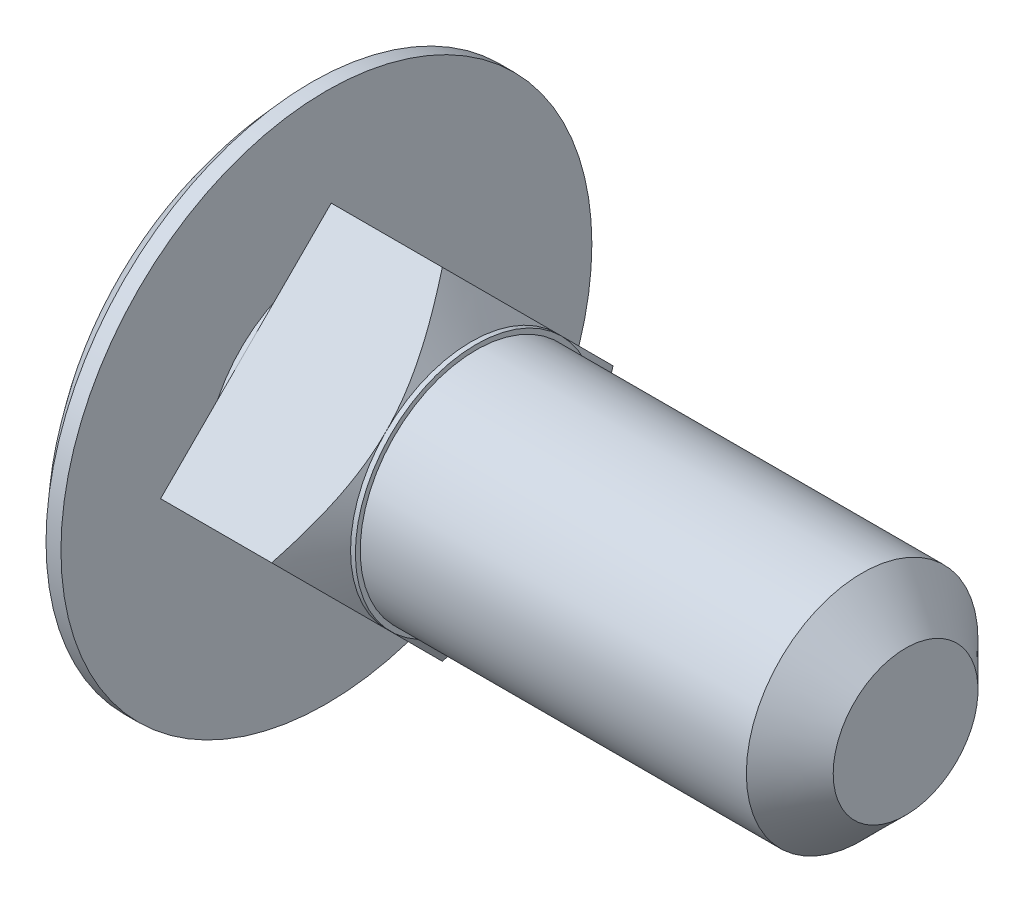
ISO-10303-21;
HEADER;
FILE_DESCRIPTION(('STEP AP214'),'2;1');
FILE_NAME('part.step','',(''),(''),'','','');
FILE_SCHEMA(('AUTOMOTIVE_DESIGN { 1 0 10303 214 1 1 1 1 }'));
ENDSEC;
DATA;
#1=APPLICATION_CONTEXT('core data for automotive mechanical design processes');
#2=APPLICATION_PROTOCOL_DEFINITION('international standard','automotive_design',2000,#1);
#3=PRODUCT_CONTEXT('',#1,'mechanical');
#4=PRODUCT('Part','Part','',(#3));
#5=PRODUCT_RELATED_PRODUCT_CATEGORY('part','',(#4));
#6=PRODUCT_DEFINITION_FORMATION('','',#4);
#7=PRODUCT_DEFINITION_CONTEXT('part definition',#1,'design');
#8=PRODUCT_DEFINITION('design','',#6,#7);
#9=PRODUCT_DEFINITION_SHAPE('','',#8);
#10=(LENGTH_UNIT() NAMED_UNIT(*) SI_UNIT(.MILLI.,.METRE.));
#11=(NAMED_UNIT(*) PLANE_ANGLE_UNIT() SI_UNIT($,.RADIAN.));
#12=(NAMED_UNIT(*) SI_UNIT($,.STERADIAN.) SOLID_ANGLE_UNIT());
#13=UNCERTAINTY_MEASURE_WITH_UNIT(LENGTH_MEASURE(1.E-05),#10,'distance_accuracy_value','');
#14=(GEOMETRIC_REPRESENTATION_CONTEXT(3) GLOBAL_UNCERTAINTY_ASSIGNED_CONTEXT((#13)) GLOBAL_UNIT_ASSIGNED_CONTEXT((#10,
#11,#12)) REPRESENTATION_CONTEXT('',''));
#15=CARTESIAN_POINT('',(0.,0.,0.));
#16=DIRECTION('',(0.,0.,1.));
#17=DIRECTION('',(1.,0.,0.));
#18=AXIS2_PLACEMENT_3D('',#15,#16,#17);
#19=CARTESIAN_POINT('',(-123.766149148481,0.,0.));
#20=DIRECTION('',(-1.,0.,0.));
#21=DIRECTION('',(0.,0.,1.));
#22=AXIS2_PLACEMENT_3D('',#19,#20,#21);
#23=CYLINDRICAL_SURFACE('',#22,2.49999999999999);
#24=CARTESIAN_POINT('',(3.,0.,0.));
#25=DIRECTION('',(-1.,0.,0.));
#26=DIRECTION('',(0.,0.,1.));
#27=AXIS2_PLACEMENT_3D('',#24,#25,#26);
#28=CIRCLE('',#27,2.49999999999999);
#29=CARTESIAN_POINT('',(3.,1.76776695296636,1.76776695296636));
#30=VERTEX_POINT('',#29);
#31=CARTESIAN_POINT('',(3.,1.76776695296636,-1.76776695296636));
#32=VERTEX_POINT('',#31);
#33=EDGE_CURVE('E116',#30,#32,#28,.T.);
#34=ORIENTED_EDGE('',*,*,#33,.F.);
#35=CARTESIAN_POINT('',(3.,0.,0.));
#36=DIRECTION('',(-1.,0.,0.));
#37=DIRECTION('',(0.,0.,1.));
#38=AXIS2_PLACEMENT_3D('',#35,#36,#37);
#39=CIRCLE('',#38,2.49999999999999);
#40=CARTESIAN_POINT('',(3.,-1.76776695296636,1.76776695296636));
#41=VERTEX_POINT('',#40);
#42=EDGE_CURVE('E130',#41,#30,#39,.T.);
#43=ORIENTED_EDGE('',*,*,#42,.F.);
#44=CARTESIAN_POINT('',(3.,-1.76776695296636,-1.76776695296636));
#45=VERTEX_POINT('',#44);
#46=EDGE_CURVE('E63',#45,#41,#39,.T.);
#47=ORIENTED_EDGE('',*,*,#46,.F.);
#48=EDGE_CURVE('E70',#32,#45,#39,.T.);
#49=ORIENTED_EDGE('',*,*,#48,.F.);
#50=EDGE_LOOP('',(#34,#43,#47,#49));
#51=FACE_BOUND('',#50,.T.);
#52=CARTESIAN_POINT('',(3.1,0.,0.));
#53=DIRECTION('',(1.,0.,0.));
#54=DIRECTION('',(0.,0.,-1.));
#55=AXIS2_PLACEMENT_3D('',#52,#53,#54);
#56=CIRCLE('',#55,2.49999999999999);
#57=CARTESIAN_POINT('',(3.1,0.,-2.49999999999999));
#58=VERTEX_POINT('',#57);
#59=EDGE_CURVE('E259',#58,#58,#56,.T.);
#60=ORIENTED_EDGE('',*,*,#59,.F.);
#61=EDGE_LOOP('',(#60));
#62=FACE_BOUND('',#61,.T.);
#63=ADVANCED_FACE('F45',(#51,#62),#23,.T.);
#64=CARTESIAN_POINT('',(16.,0.,-3.53553390593273));
#65=DIRECTION('',(0.,0.707106781186548,0.707106781186547));
#66=DIRECTION('',(0.,-0.707106781186547,0.707106781186548));
#67=AXIS2_PLACEMENT_3D('',#64,#65,#66);
#68=PLANE('',#67);
#69=CARTESIAN_POINT('',(2.40201874733513,-3.53573390593273,0.000200000000000818));
#70=CARTESIAN_POINT('',(2.43671557025377,-3.47561880308857,-0.0599151028441577));
#71=CARTESIAN_POINT('',(2.47067722215908,-3.41528649803282,-0.12024740789991));
#72=CARTESIAN_POINT('',(2.53678227321206,-3.2941027776801,-0.24143112825262));
#73=CARTESIAN_POINT('',(2.56892503658612,-3.23325118932196,-0.30228271661076));
#74=CARTESIAN_POINT('',(2.63121133461051,-3.110608727591,-0.424925178341725));
#75=CARTESIAN_POINT('',(2.66134131191625,-3.04881437550348,-0.48671953042924));
#76=CARTESIAN_POINT('',(2.71890873900683,-2.92461349818753,-0.610920407745193));
#77=CARTESIAN_POINT('',(2.74634641700413,-2.86220702533956,-0.673326880593162));
#78=CARTESIAN_POINT('',(2.8229480018304,-2.67608083365178,-0.859453072280948));
#79=CARTESIAN_POINT('',(2.86750288830657,-2.55135409029411,-0.984179815638615));
#80=CARTESIAN_POINT('',(2.92124771969196,-2.36255635343809,-1.17297755249464));
#81=CARTESIAN_POINT('',(2.9369717866986,-2.29940608743339,-1.23612781849934));
#82=CARTESIAN_POINT('',(2.96348279881809,-2.17258524568277,-1.36294866024995));
#83=CARTESIAN_POINT('',(2.97427032667096,-2.10891473225378,-1.42661917367895));
#84=CARTESIAN_POINT('',(2.98910838620683,-1.9916561587192,-1.54387774721353));
#85=CARTESIAN_POINT('',(2.99397131147019,-1.93811923506152,-1.5974146708712));
#86=CARTESIAN_POINT('',(2.99973885178925,-1.83093325042768,-1.70460065550505));
#87=CARTESIAN_POINT('',(3.00064319814561,-1.77728418208666,-1.75824972384606));
#88=CARTESIAN_POINT('',(2.99845784161728,-1.67000893887109,-1.86552496706163));
#89=CARTESIAN_POINT('',(2.99536681391497,-1.61638277749145,-1.91915112844127));
#90=CARTESIAN_POINT('',(2.98530243568845,-1.50931002809058,-2.02622387784214));
#91=CARTESIAN_POINT('',(2.97832853780704,-1.4558634664559,-2.07967043947683));
#92=CARTESIAN_POINT('',(2.9518793842428,-1.29581186111602,-2.23972204481671));
#93=CARTESIAN_POINT('',(2.92688092822718,-1.18965140469514,-2.34588250123759));
#94=CARTESIAN_POINT('',(2.86492933565562,-0.979138019292074,-2.55639588664065));
#95=CARTESIAN_POINT('',(2.82797342425705,-0.874785515790358,-2.66074839014237));
#96=CARTESIAN_POINT('',(2.760120168614,-0.705551012755568,-2.82998289317716));
#97=CARTESIAN_POINT('',(2.73190741292772,-0.640116481105585,-2.89541742482714));
#98=CARTESIAN_POINT('',(2.67246777242789,-0.509958226774786,-3.02557567915794));
#99=CARTESIAN_POINT('',(2.64124179297778,-0.44523429705378,-3.09029960887895));
#100=CARTESIAN_POINT('',(2.57648618456147,-0.316746160393614,-3.21878774553911));
#101=CARTESIAN_POINT('',(2.54296925570267,-0.2529787266166,-3.28255517931613));
#102=CARTESIAN_POINT('',(2.47390909080607,-0.125994463963829,-3.4095394419689));
#103=CARTESIAN_POINT('',(2.43836587757942,-0.0627776288988664,-3.47275627703386));
#104=CARTESIAN_POINT('',(2.40201874733513,0.000200000000001087,-3.53573390593273));
#105=B_SPLINE_CURVE_WITH_KNOTS('',3,(#69,#70,#71,#72,#73,#74,#75,#76,#77,#78,#79,#80,#81,#82,
#83,#84,#85,#86,#87,#88,#89,#90,#91,#92,#93,#94,#95,#96,#97,#98,#99,#100,#101,#102,#103,#104),
.UNSPECIFIED.,.F.,.F.,(4,2,2,2,2,2,2,2,2,2,2,2,2,2,2,2,2,4),(0.,0.275475539476327,
0.551046781231073,0.828318120842899,1.10556593723789,1.65057241705638,1.9225075976811,
2.19441066908645,2.42191941988835,2.64944361322758,2.87704327018981,3.10467501935621,
3.56059960912838,4.0166300765631,4.30680999747198,4.59690299981775,4.88550112582574,
5.17409600354402),.UNSPECIFIED.);
#106=CARTESIAN_POINT('',(2.40213422065477,-3.53553390593273,0.));
#107=VERTEX_POINT('',#106);
#108=EDGE_CURVE('E147',#107,#45,#105,.T.);
#109=ORIENTED_EDGE('',*,*,#108,.F.);
#110=DIRECTION('',(-1.,0.,0.));
#111=VECTOR('',#110,1.);
#112=CARTESIAN_POINT('',(16.,-3.53553390593273,0.));
#113=LINE('',#112,#111);
#114=CARTESIAN_POINT('',(0.1,-3.53553390593273,0.));
#115=VERTEX_POINT('',#114);
#116=EDGE_CURVE('E206',#107,#115,#113,.T.);
#117=ORIENTED_EDGE('',*,*,#116,.T.);
#118=DIRECTION('',(0.,0.707106781186547,-0.707106781186548));
#119=VECTOR('',#118,1.);
#120=CARTESIAN_POINT('',(0.1,0.,-3.53553390593273));
#121=LINE('',#120,#119);
#122=CARTESIAN_POINT('',(0.1,-1.76776695296636,-1.76776695296636));
#123=VERTEX_POINT('',#122);
#124=EDGE_CURVE('E220',#115,#123,#121,.T.);
#125=ORIENTED_EDGE('',*,*,#124,.T.);
#126=CARTESIAN_POINT('',(0.1,0.,-3.53553390593273));
#127=VERTEX_POINT('',#126);
#128=EDGE_CURVE('E463',#123,#127,#121,.T.);
#129=ORIENTED_EDGE('',*,*,#128,.T.);
#130=DIRECTION('',(-1.,0.,0.));
#131=VECTOR('',#130,1.);
#132=CARTESIAN_POINT('',(16.,0.,-3.53553390593273));
#133=LINE('',#132,#131);
#134=CARTESIAN_POINT('',(2.40213422065477,0.,-3.53553390593273));
#135=VERTEX_POINT('',#134);
#136=EDGE_CURVE('E214',#135,#127,#133,.T.);
#137=ORIENTED_EDGE('',*,*,#136,.F.);
#138=EDGE_CURVE('E124',#45,#135,#105,.T.);
#139=ORIENTED_EDGE('',*,*,#138,.F.);
#140=EDGE_LOOP('',(#109,#117,#125,#129,#137,#139));
#141=FACE_BOUND('',#140,.T.);
#142=ADVANCED_FACE('F192',(#141),#68,.F.);
#143=CARTESIAN_POINT('',(16.,0.,3.53553390593273));
#144=DIRECTION('',(0.,0.707106781186547,-0.707106781186548));
#145=DIRECTION('',(0.,0.707106781186548,0.707106781186547));
#146=AXIS2_PLACEMENT_3D('',#143,#144,#145);
#147=PLANE('',#146);
#148=CARTESIAN_POINT('',(2.40201874733513,0.00019999999999993,3.53573390593273));
#149=CARTESIAN_POINT('',(2.43671557025377,-0.0599151028441583,3.47561880308857));
#150=CARTESIAN_POINT('',(2.47067722215908,-0.120247407899911,3.41528649803281));
#151=CARTESIAN_POINT('',(2.53678227321206,-0.241431128252621,3.2941027776801));
#152=CARTESIAN_POINT('',(2.56892503658612,-0.302282716610762,3.23325118932196));
#153=CARTESIAN_POINT('',(2.63121133461051,-0.424925178341726,3.110608727591));
#154=CARTESIAN_POINT('',(2.66134131191625,-0.486719530429241,3.04881437550348));
#155=CARTESIAN_POINT('',(2.71890873900683,-0.610920407745194,2.92461349818753));
#156=CARTESIAN_POINT('',(2.74634641700413,-0.673326880593163,2.86220702533956));
#157=CARTESIAN_POINT('',(2.8229480018304,-0.85945307228095,2.67608083365178));
#158=CARTESIAN_POINT('',(2.86750288830657,-0.984179815638616,2.55135409029411));
#159=CARTESIAN_POINT('',(2.92124771969196,-1.17297755249464,2.36255635343809));
#160=CARTESIAN_POINT('',(2.9369717866986,-1.23612781849934,2.29940608743339));
#161=CARTESIAN_POINT('',(2.96348279881809,-1.36294866024995,2.17258524568277));
#162=CARTESIAN_POINT('',(2.97427032667096,-1.42661917367895,2.10891473225378));
#163=CARTESIAN_POINT('',(2.98910838620683,-1.54387774721353,1.9916561587192));
#164=CARTESIAN_POINT('',(2.99397131147019,-1.5974146708712,1.93811923506152));
#165=CARTESIAN_POINT('',(2.99973885178925,-1.70460065550505,1.83093325042768));
#166=CARTESIAN_POINT('',(3.00064319814561,-1.75824972384607,1.77728418208666));
#167=CARTESIAN_POINT('',(2.99845784161728,-1.86552496706164,1.67000893887109));
#168=CARTESIAN_POINT('',(2.99536681391497,-1.91915112844128,1.61638277749145));
#169=CARTESIAN_POINT('',(2.98530243568844,-2.02622387784215,1.50931002809058));
#170=CARTESIAN_POINT('',(2.97832853780704,-2.07967043947683,1.4558634664559));
#171=CARTESIAN_POINT('',(2.9518793842428,-2.23972204481671,1.29581186111602));
#172=CARTESIAN_POINT('',(2.92688092822718,-2.34588250123759,1.18965140469514));
#173=CARTESIAN_POINT('',(2.86492933565562,-2.55639588664066,0.97913801929207));
#174=CARTESIAN_POINT('',(2.82797342425705,-2.66074839014237,0.874785515790354));
#175=CARTESIAN_POINT('',(2.760120168614,-2.82998289317716,0.705551012755564));
#176=CARTESIAN_POINT('',(2.73190741292772,-2.89541742482714,0.640116481105582));
#177=CARTESIAN_POINT('',(2.67246777242789,-3.02557567915794,0.509958226774784));
#178=CARTESIAN_POINT('',(2.64124179297778,-3.09029960887895,0.445234297053778));
#179=CARTESIAN_POINT('',(2.57648618456147,-3.21878774553911,0.316746160393614));
#180=CARTESIAN_POINT('',(2.54296925570267,-3.28255517931613,0.2529787266166));
#181=CARTESIAN_POINT('',(2.47390909080607,-3.4095394419689,0.125994463963829));
#182=CARTESIAN_POINT('',(2.43836587757942,-3.47275627703386,0.0627776288988678));
#183=CARTESIAN_POINT('',(2.40201874733513,-3.53573390593273,-0.000199999999998923));
#184=B_SPLINE_CURVE_WITH_KNOTS('',3,(#148,#149,#150,#151,#152,#153,#154,#155,#156,#157,#158,
#159,#160,#161,#162,#163,#164,#165,#166,#167,#168,#169,#170,#171,#172,#173,#174,#175,#176,#177,
#178,#179,#180,#181,#182,#183),.UNSPECIFIED.,.F.,.F.,(4,2,2,2,2,2,2,2,2,2,2,2,2,2,2,2,2,4),(0.,
0.275475539476327,0.551046781231073,0.828318120842899,1.10556593723789,1.65057241705638,
1.9225075976811,2.19441066908645,2.42191941988835,2.64944361322758,2.87704327018982,
3.10467501935622,3.56059960912839,4.01663007656311,4.30680999747199,4.59690299981775,
4.88550112582574,5.17409600354402),.UNSPECIFIED.);
#185=CARTESIAN_POINT('',(2.40213422065477,0.,3.53553390593273));
#186=VERTEX_POINT('',#185);
#187=EDGE_CURVE('E133',#186,#41,#184,.T.);
#188=ORIENTED_EDGE('',*,*,#187,.F.);
#189=DIRECTION('',(-1.,0.,0.));
#190=VECTOR('',#189,1.);
#191=CARTESIAN_POINT('',(16.,0.,3.53553390593273));
#192=LINE('',#191,#190);
#193=CARTESIAN_POINT('',(0.1,0.,3.53553390593273));
#194=VERTEX_POINT('',#193);
#195=EDGE_CURVE('E144',#186,#194,#192,.T.);
#196=ORIENTED_EDGE('',*,*,#195,.T.);
#197=DIRECTION('',(0.,-0.707106781186548,-0.707106781186547));
#198=VECTOR('',#197,1.);
#199=CARTESIAN_POINT('',(0.1,0.,3.53553390593273));
#200=LINE('',#199,#198);
#201=CARTESIAN_POINT('',(0.1,-1.76776695296636,1.76776695296636));
#202=VERTEX_POINT('',#201);
#203=EDGE_CURVE('E465',#194,#202,#200,.T.);
#204=ORIENTED_EDGE('',*,*,#203,.T.);
#205=EDGE_CURVE('E211',#202,#115,#200,.T.);
#206=ORIENTED_EDGE('',*,*,#205,.T.);
#207=ORIENTED_EDGE('',*,*,#116,.F.);
#208=EDGE_CURVE('E146',#41,#107,#184,.T.);
#209=ORIENTED_EDGE('',*,*,#208,.F.);
#210=EDGE_LOOP('',(#188,#196,#204,#206,#207,#209));
#211=FACE_BOUND('',#210,.T.);
#212=ADVANCED_FACE('F189',(#211),#147,.F.);
#213=CARTESIAN_POINT('',(16.,3.53553390593273,0.));
#214=DIRECTION('',(0.,-0.707106781186547,-0.707106781186548));
#215=DIRECTION('',(0.,0.707106781186548,-0.707106781186547));
#216=AXIS2_PLACEMENT_3D('',#213,#214,#215);
#217=PLANE('',#216);
#218=CARTESIAN_POINT('',(2.40201874733513,3.53573390593273,-0.000199999999999861));
#219=CARTESIAN_POINT('',(2.43671557025377,3.47561880308857,0.0599151028441577));
#220=CARTESIAN_POINT('',(2.47067722215908,3.41528649803281,0.12024740789991));
#221=CARTESIAN_POINT('',(2.53678227321206,3.2941027776801,0.24143112825262));
#222=CARTESIAN_POINT('',(2.56892503658612,3.23325118932196,0.302282716610761));
#223=CARTESIAN_POINT('',(2.63121133461051,3.110608727591,0.424925178341725));
#224=CARTESIAN_POINT('',(2.66134131191625,3.04881437550349,0.48671953042924));
#225=CARTESIAN_POINT('',(2.71890873900683,2.92461349818753,0.610920407745192));
#226=CARTESIAN_POINT('',(2.74634641700413,2.86220702533956,0.673326880593162));
#227=CARTESIAN_POINT('',(2.8229480018304,2.67608083365178,0.859453072280948));
#228=CARTESIAN_POINT('',(2.86750288830657,2.55135409029411,0.984179815638614));
#229=CARTESIAN_POINT('',(2.92124771969196,2.36255635343809,1.17297755249464));
#230=CARTESIAN_POINT('',(2.9369717866986,2.29940608743339,1.23612781849934));
#231=CARTESIAN_POINT('',(2.96348279881809,2.17258524568277,1.36294866024995));
#232=CARTESIAN_POINT('',(2.97427032667096,2.10891473225378,1.42661917367895));
#233=CARTESIAN_POINT('',(2.98910838620683,1.9916561587192,1.54387774721353));
#234=CARTESIAN_POINT('',(2.99397131147019,1.93811923506152,1.5974146708712));
#235=CARTESIAN_POINT('',(2.99973885178925,1.83093325042768,1.70460065550505));
#236=CARTESIAN_POINT('',(3.00064319814561,1.77728418208666,1.75824972384606));
#237=CARTESIAN_POINT('',(2.99845784161728,1.67000893887109,1.86552496706164));
#238=CARTESIAN_POINT('',(2.99536681391497,1.61638277749145,1.91915112844128));
#239=CARTESIAN_POINT('',(2.98530243568845,1.50931002809058,2.02622387784214));
#240=CARTESIAN_POINT('',(2.97832853780704,1.4558634664559,2.07967043947683));
#241=CARTESIAN_POINT('',(2.9518793842428,1.29581186111602,2.23972204481671));
#242=CARTESIAN_POINT('',(2.92688092822718,1.18965140469514,2.34588250123759));
#243=CARTESIAN_POINT('',(2.86492933565562,0.979138019292073,2.55639588664065));
#244=CARTESIAN_POINT('',(2.82797342425705,0.874785515790357,2.66074839014237));
#245=CARTESIAN_POINT('',(2.760120168614,0.705551012755567,2.82998289317716));
#246=CARTESIAN_POINT('',(2.73190741292772,0.640116481105585,2.89541742482714));
#247=CARTESIAN_POINT('',(2.67246777242789,0.509958226774786,3.02557567915794));
#248=CARTESIAN_POINT('',(2.64124179297778,0.44523429705378,3.09029960887894));
#249=CARTESIAN_POINT('',(2.57648618456147,0.316746160393615,3.21878774553911));
#250=CARTESIAN_POINT('',(2.54296925570267,0.252978726616601,3.28255517931612));
#251=CARTESIAN_POINT('',(2.47390909080607,0.125994463963829,3.4095394419689));
#252=CARTESIAN_POINT('',(2.43836587757942,0.0627776288988671,3.47275627703386));
#253=CARTESIAN_POINT('',(2.40201874733513,-0.000200000000000294,3.53573390593273));
#254=B_SPLINE_CURVE_WITH_KNOTS('',3,(#218,#219,#220,#221,#222,#223,#224,#225,#226,#227,#228,
#229,#230,#231,#232,#233,#234,#235,#236,#237,#238,#239,#240,#241,#242,#243,#244,#245,#246,#247,
#248,#249,#250,#251,#252,#253),.UNSPECIFIED.,.F.,.F.,(4,2,2,2,2,2,2,2,2,2,2,2,2,2,2,2,2,4),(0.,
0.275475539476327,0.551046781231072,0.828318120842898,1.10556593723789,1.65057241705637,
1.9225075976811,2.19441066908645,2.42191941988835,2.64944361322758,2.87704327018981,
3.10467501935621,3.56059960912838,4.0166300765631,4.30680999747199,4.59690299981775,
4.88550112582574,5.17409600354402),.UNSPECIFIED.);
#255=CARTESIAN_POINT('',(2.40213422065477,3.53553390593273,0.));
#256=VERTEX_POINT('',#255);
#257=EDGE_CURVE('E113',#256,#30,#254,.T.);
#258=ORIENTED_EDGE('',*,*,#257,.F.);
#259=DIRECTION('',(-1.,0.,0.));
#260=VECTOR('',#259,1.);
#261=CARTESIAN_POINT('',(16.,3.53553390593273,0.));
#262=LINE('',#261,#260);
#263=CARTESIAN_POINT('',(0.1,3.53553390593273,0.));
#264=VERTEX_POINT('',#263);
#265=EDGE_CURVE('E218',#256,#264,#262,.T.);
#266=ORIENTED_EDGE('',*,*,#265,.T.);
#267=DIRECTION('',(0.,-0.707106781186548,0.707106781186547));
#268=VECTOR('',#267,1.);
#269=CARTESIAN_POINT('',(0.1,3.53553390593273,0.));
#270=LINE('',#269,#268);
#271=CARTESIAN_POINT('',(0.100000000000003,1.76776695296636,1.76776695296636));
#272=VERTEX_POINT('',#271);
#273=EDGE_CURVE('E455',#264,#272,#270,.T.);
#274=ORIENTED_EDGE('',*,*,#273,.T.);
#275=EDGE_CURVE('E470',#272,#194,#270,.T.);
#276=ORIENTED_EDGE('',*,*,#275,.T.);
#277=ORIENTED_EDGE('',*,*,#195,.F.);
#278=EDGE_CURVE('E127',#30,#186,#254,.T.);
#279=ORIENTED_EDGE('',*,*,#278,.F.);
#280=EDGE_LOOP('',(#258,#266,#274,#276,#277,#279));
#281=FACE_BOUND('',#280,.T.);
#282=ADVANCED_FACE('F142',(#281),#217,.F.);
#283=CARTESIAN_POINT('',(16.,3.53553390593273,0.));
#284=DIRECTION('',(0.,-0.707106781186548,0.707106781186547));
#285=DIRECTION('',(0.,-0.707106781186547,-0.707106781186548));
#286=AXIS2_PLACEMENT_3D('',#283,#284,#285);
#287=PLANE('',#286);
#288=CARTESIAN_POINT('',(2.40201874733513,-0.000199999999999225,-3.53573390593273));
#289=CARTESIAN_POINT('',(2.43671557025377,0.0599151028441586,-3.47561880308857));
#290=CARTESIAN_POINT('',(2.47067722215908,0.120247407899911,-3.41528649803282));
#291=CARTESIAN_POINT('',(2.53678227321206,0.241431128252621,-3.29410277768011));
#292=CARTESIAN_POINT('',(2.56892503658612,0.302282716610762,-3.23325118932196));
#293=CARTESIAN_POINT('',(2.63121133461051,0.424925178341726,-3.110608727591));
#294=CARTESIAN_POINT('',(2.66134131191625,0.486719530429241,-3.04881437550348));
#295=CARTESIAN_POINT('',(2.71890873900682,0.610920407745193,-2.92461349818753));
#296=CARTESIAN_POINT('',(2.74634641700413,0.673326880593163,-2.86220702533956));
#297=CARTESIAN_POINT('',(2.8229480018304,0.85945307228095,-2.67608083365178));
#298=CARTESIAN_POINT('',(2.86750288830657,0.984179815638615,-2.55135409029411));
#299=CARTESIAN_POINT('',(2.92124771969196,1.17297755249464,-2.36255635343809));
#300=CARTESIAN_POINT('',(2.9369717866986,1.23612781849934,-2.29940608743339));
#301=CARTESIAN_POINT('',(2.96348279881809,1.36294866024995,-2.17258524568277));
#302=CARTESIAN_POINT('',(2.97427032667096,1.42661917367895,-2.10891473225378));
#303=CARTESIAN_POINT('',(2.98910838620683,1.54387774721353,-1.9916561587192));
#304=CARTESIAN_POINT('',(2.99397131147019,1.5974146708712,-1.93811923506152));
#305=CARTESIAN_POINT('',(2.99973885178925,1.70460065550505,-1.83093325042768));
#306=CARTESIAN_POINT('',(3.00064319814561,1.75824972384606,-1.77728418208666));
#307=CARTESIAN_POINT('',(2.99845784161728,1.86552496706164,-1.67000893887109));
#308=CARTESIAN_POINT('',(2.99536681391497,1.91915112844128,-1.61638277749145));
#309=CARTESIAN_POINT('',(2.98530243568844,2.02622387784214,-1.50931002809058));
#310=CARTESIAN_POINT('',(2.97832853780704,2.07967043947683,-1.4558634664559));
#311=CARTESIAN_POINT('',(2.9518793842428,2.23972204481671,-1.29581186111602));
#312=CARTESIAN_POINT('',(2.92688092822718,2.34588250123759,-1.18965140469514));
#313=CARTESIAN_POINT('',(2.86492933565562,2.55639588664065,-0.979138019292073));
#314=CARTESIAN_POINT('',(2.82797342425705,2.66074839014237,-0.874785515790357));
#315=CARTESIAN_POINT('',(2.760120168614,2.82998289317716,-0.705551012755567));
#316=CARTESIAN_POINT('',(2.73190741292772,2.89541742482714,-0.640116481105584));
#317=CARTESIAN_POINT('',(2.67246777242789,3.02557567915794,-0.509958226774785));
#318=CARTESIAN_POINT('',(2.64124179297778,3.09029960887895,-0.445234297053779));
#319=CARTESIAN_POINT('',(2.57648618456147,3.21878774553911,-0.316746160393614));
#320=CARTESIAN_POINT('',(2.54296925570267,3.28255517931612,-0.2529787266166));
#321=CARTESIAN_POINT('',(2.47390909080607,3.4095394419689,-0.125994463963829));
#322=CARTESIAN_POINT('',(2.43836587757942,3.47275627703386,-0.0627776288988666));
#323=CARTESIAN_POINT('',(2.40201874733513,3.53573390593273,0.000200000000000486));
#324=B_SPLINE_CURVE_WITH_KNOTS('',3,(#288,#289,#290,#291,#292,#293,#294,#295,#296,#297,#298,
#299,#300,#301,#302,#303,#304,#305,#306,#307,#308,#309,#310,#311,#312,#313,#314,#315,#316,#317,
#318,#319,#320,#321,#322,#323),.UNSPECIFIED.,.F.,.F.,(4,2,2,2,2,2,2,2,2,2,2,2,2,2,2,2,2,4),(0.,
0.275475539476327,0.551046781231073,0.828318120842899,1.10556593723789,1.65057241705638,
1.9225075976811,2.19441066908645,2.42191941988835,2.64944361322758,2.87704327018981,
3.10467501935622,3.56059960912839,4.01663007656311,4.30680999747199,4.59690299981775,
4.88550112582574,5.17409600354402),.UNSPECIFIED.);
#325=EDGE_CURVE('E125',#135,#32,#324,.T.);
#326=ORIENTED_EDGE('',*,*,#325,.F.);
#327=ORIENTED_EDGE('',*,*,#136,.T.);
#328=DIRECTION('',(0.,0.707106781186547,0.707106781186548));
#329=VECTOR('',#328,1.);
#330=CARTESIAN_POINT('',(0.1,3.53553390593273,0.));
#331=LINE('',#330,#329);
#332=CARTESIAN_POINT('',(0.1,1.76776695296636,-1.76776695296636));
#333=VERTEX_POINT('',#332);
#334=EDGE_CURVE('E187',#127,#333,#331,.T.);
#335=ORIENTED_EDGE('',*,*,#334,.T.);
#336=EDGE_CURVE('E456',#333,#264,#331,.T.);
#337=ORIENTED_EDGE('',*,*,#336,.T.);
#338=ORIENTED_EDGE('',*,*,#265,.F.);
#339=EDGE_CURVE('E119',#32,#256,#324,.T.);
#340=ORIENTED_EDGE('',*,*,#339,.F.);
#341=EDGE_LOOP('',(#326,#327,#335,#337,#338,#340));
#342=FACE_BOUND('',#341,.T.);
#343=ADVANCED_FACE('F253',(#342),#287,.F.);
#344=CARTESIAN_POINT('',(0.100000000000003,0.,0.));
#345=DIRECTION('',(-1.,0.,0.));
#346=DIRECTION('',(0.,0.,1.));
#347=AXIS2_PLACEMENT_3D('',#344,#345,#346);
#348=CIRCLE('',#347,2.49999999999999);
#349=EDGE_CURVE('E56',#202,#272,#348,.T.);
#350=ORIENTED_EDGE('',*,*,#349,.T.);
#351=EDGE_CURVE('E13',#272,#333,#348,.T.);
#352=ORIENTED_EDGE('',*,*,#351,.T.);
#353=EDGE_CURVE('E55',#333,#123,#348,.T.);
#354=ORIENTED_EDGE('',*,*,#353,.T.);
#355=EDGE_CURVE('E242',#123,#202,#348,.T.);
#356=ORIENTED_EDGE('',*,*,#355,.T.);
#357=EDGE_LOOP('',(#350,#352,#354,#356));
#358=FACE_BOUND('',#357,.T.);
#359=CARTESIAN_POINT('',(0.,0.,0.));
#360=DIRECTION('',(-1.,0.,0.));
#361=DIRECTION('',(0.,0.,1.));
#362=AXIS2_PLACEMENT_3D('',#359,#360,#361);
#363=CIRCLE('',#362,2.49999999999999);
#364=CARTESIAN_POINT('',(0.,0.,2.49999999999999));
#365=VERTEX_POINT('',#364);
#366=EDGE_CURVE('E234',#365,#365,#363,.T.);
#367=ORIENTED_EDGE('',*,*,#366,.F.);
#368=EDGE_LOOP('',(#367));
#369=FACE_BOUND('',#368,.T.);
#370=ADVANCED_FACE('F201',(#358,#369),#23,.T.);
#371=CARTESIAN_POINT('',(0.,2.49999999999999,0.));
#372=DIRECTION('',(-1.,0.,0.));
#373=DIRECTION('',(0.,0.,1.));
#374=AXIS2_PLACEMENT_3D('',#371,#372,#373);
#375=PLANE('',#374);
#376=CARTESIAN_POINT('',(0.,0.,0.));
#377=DIRECTION('',(-1.,0.,0.));
#378=DIRECTION('',(0.,0.,1.));
#379=AXIS2_PLACEMENT_3D('',#376,#377,#378);
#380=CIRCLE('',#379,5.5);
#381=CARTESIAN_POINT('',(0.,0.,5.5));
#382=VERTEX_POINT('',#381);
#383=EDGE_CURVE('E230',#382,#382,#380,.T.);
#384=ORIENTED_EDGE('',*,*,#383,.F.);
#385=EDGE_LOOP('',(#384));
#386=FACE_BOUND('',#385,.T.);
#387=ORIENTED_EDGE('',*,*,#366,.T.);
#388=EDGE_LOOP('',(#387));
#389=FACE_BOUND('',#388,.T.);
#390=ADVANCED_FACE('F342',(#386,#389),#375,.F.);
#391=CARTESIAN_POINT('',(-123.766149148481,0.,0.));
#392=DIRECTION('',(-1.,0.,0.));
#393=DIRECTION('',(0.,0.,1.));
#394=AXIS2_PLACEMENT_3D('',#391,#392,#393);
#395=CYLINDRICAL_SURFACE('',#394,5.5);
#396=CARTESIAN_POINT('',(-0.309475019311126,0.,0.));
#397=DIRECTION('',(-1.,0.,0.));
#398=DIRECTION('',(0.,0.,1.));
#399=AXIS2_PLACEMENT_3D('',#396,#397,#398);
#400=CIRCLE('',#399,5.5);
#401=CARTESIAN_POINT('',(-0.309475019311126,0.,5.5));
#402=VERTEX_POINT('',#401);
#403=EDGE_CURVE('E226',#402,#402,#400,.T.);
#404=ORIENTED_EDGE('',*,*,#403,.F.);
#405=EDGE_LOOP('',(#404));
#406=FACE_BOUND('',#405,.T.);
#407=ORIENTED_EDGE('',*,*,#383,.T.);
#408=EDGE_LOOP('',(#407));
#409=FACE_BOUND('',#408,.T.);
#410=ADVANCED_FACE('F333',(#406,#409),#395,.T.);
#411=CARTESIAN_POINT('',(5.5,0.,0.));
#412=DIRECTION('',(-1.,0.,0.));
#413=DIRECTION('',(0.,1.,0.));
#414=AXIS2_PLACEMENT_3D('',#411,#412,#413);
#415=SPHERICAL_SURFACE('',#414,8.);
#416=ORIENTED_EDGE('',*,*,#403,.T.);
#417=EDGE_LOOP('',(#416));
#418=FACE_BOUND('',#417,.T.);
#419=ADVANCED_FACE('F325',(#418),#415,.T.);
#420=CARTESIAN_POINT('',(0.1,0.,0.));
#421=DIRECTION('',(-1.,0.,0.));
#422=DIRECTION('',(0.,0.,1.));
#423=AXIS2_PLACEMENT_3D('',#420,#421,#422);
#424=PLANE('',#423);
#425=ORIENTED_EDGE('',*,*,#351,.F.);
#426=ORIENTED_EDGE('',*,*,#273,.F.);
#427=ORIENTED_EDGE('',*,*,#336,.F.);
#428=EDGE_LOOP('',(#425,#426,#427));
#429=FACE_BOUND('',#428,.T.);
#430=ADVANCED_FACE('F302',(#429),#424,.T.);
#431=ORIENTED_EDGE('',*,*,#353,.F.);
#432=ORIENTED_EDGE('',*,*,#334,.F.);
#433=ORIENTED_EDGE('',*,*,#128,.F.);
#434=EDGE_LOOP('',(#431,#432,#433));
#435=FACE_BOUND('',#434,.T.);
#436=ADVANCED_FACE('F310',(#435),#424,.T.);
#437=ORIENTED_EDGE('',*,*,#355,.F.);
#438=ORIENTED_EDGE('',*,*,#124,.F.);
#439=ORIENTED_EDGE('',*,*,#205,.F.);
#440=EDGE_LOOP('',(#437,#438,#439));
#441=FACE_BOUND('',#440,.T.);
#442=ADVANCED_FACE('F300',(#441),#424,.T.);
#443=ORIENTED_EDGE('',*,*,#349,.F.);
#444=ORIENTED_EDGE('',*,*,#203,.F.);
#445=ORIENTED_EDGE('',*,*,#275,.F.);
#446=EDGE_LOOP('',(#443,#444,#445));
#447=FACE_BOUND('',#446,.T.);
#448=ADVANCED_FACE('F175',(#447),#424,.T.);
#449=CARTESIAN_POINT('',(2.40213422065477,0.,0.));
#450=DIRECTION('',(-1.,0.,0.));
#451=DIRECTION('',(0.,0.,1.));
#452=AXIS2_PLACEMENT_3D('',#449,#450,#451);
#453=CONICAL_SURFACE('',#452,3.53553390593273,1.04719755119661);
#454=ORIENTED_EDGE('',*,*,#187,.T.);
#455=ORIENTED_EDGE('',*,*,#42,.T.);
#456=ORIENTED_EDGE('',*,*,#278,.T.);
#457=EDGE_LOOP('',(#454,#455,#456));
#458=FACE_BOUND('',#457,.T.);
#459=ADVANCED_FACE('F131',(#458),#453,.T.);
#460=ORIENTED_EDGE('',*,*,#257,.T.);
#461=ORIENTED_EDGE('',*,*,#33,.T.);
#462=ORIENTED_EDGE('',*,*,#339,.T.);
#463=EDGE_LOOP('',(#460,#461,#462));
#464=FACE_BOUND('',#463,.T.);
#465=ADVANCED_FACE('F115',(#464),#453,.T.);
#466=ORIENTED_EDGE('',*,*,#138,.T.);
#467=ORIENTED_EDGE('',*,*,#325,.T.);
#468=ORIENTED_EDGE('',*,*,#48,.T.);
#469=EDGE_LOOP('',(#466,#467,#468));
#470=FACE_BOUND('',#469,.T.);
#471=ADVANCED_FACE('F249',(#470),#453,.T.);
#472=ORIENTED_EDGE('',*,*,#208,.T.);
#473=ORIENTED_EDGE('',*,*,#108,.T.);
#474=ORIENTED_EDGE('',*,*,#46,.T.);
#475=EDGE_LOOP('',(#472,#473,#474));
#476=FACE_BOUND('',#475,.T.);
#477=ADVANCED_FACE('F176',(#476),#453,.T.);
#478=CARTESIAN_POINT('',(3.1,0.,0.));
#479=DIRECTION('',(1.,0.,0.));
#480=DIRECTION('',(0.,0.,-1.));
#481=AXIS2_PLACEMENT_3D('',#478,#479,#480);
#482=CYLINDRICAL_SURFACE('',#481,2.39999999999999);
#483=CARTESIAN_POINT('',(3.1,0.,0.));
#484=DIRECTION('',(1.,0.,0.));
#485=DIRECTION('',(0.,0.,-1.));
#486=AXIS2_PLACEMENT_3D('',#483,#484,#485);
#487=CIRCLE('',#486,2.39999999999999);
#488=CARTESIAN_POINT('',(3.1,0.,-2.39999999999999));
#489=VERTEX_POINT('',#488);
#490=EDGE_CURVE('E262',#489,#489,#487,.T.);
#491=ORIENTED_EDGE('',*,*,#490,.T.);
#492=EDGE_LOOP('',(#491));
#493=FACE_BOUND('',#492,.T.);
#494=CARTESIAN_POINT('',(11.1,0.,0.));
#495=DIRECTION('',(-1.,0.,0.));
#496=DIRECTION('',(0.,0.,1.));
#497=AXIS2_PLACEMENT_3D('',#494,#495,#496);
#498=CIRCLE('',#497,2.39999999999999);
#499=CARTESIAN_POINT('',(11.1,0.,2.39999999999999));
#500=VERTEX_POINT('',#499);
#501=EDGE_CURVE('E49',#500,#500,#498,.T.);
#502=ORIENTED_EDGE('',*,*,#501,.T.);
#503=EDGE_LOOP('',(#502));
#504=FACE_BOUND('',#503,.T.);
#505=ADVANCED_FACE('F268',(#493,#504),#482,.T.);
#506=CARTESIAN_POINT('',(3.1,0.,0.));
#507=DIRECTION('',(1.,0.,0.));
#508=DIRECTION('',(0.,0.,-1.));
#509=AXIS2_PLACEMENT_3D('',#506,#507,#508);
#510=PLANE('',#509);
#511=ORIENTED_EDGE('',*,*,#490,.F.);
#512=EDGE_LOOP('',(#511));
#513=FACE_BOUND('',#512,.T.);
#514=ORIENTED_EDGE('',*,*,#59,.T.);
#515=EDGE_LOOP('',(#514));
#516=FACE_BOUND('',#515,.T.);
#517=ADVANCED_FACE('F177',(#513,#516),#510,.T.);
#518=CARTESIAN_POINT('',(12.,0.,0.));
#519=DIRECTION('',(-1.,0.,0.));
#520=DIRECTION('',(0.,0.,1.));
#521=AXIS2_PLACEMENT_3D('',#518,#519,#520);
#522=PLANE('',#521);
#523=CARTESIAN_POINT('',(12.,0.,0.));
#524=DIRECTION('',(-1.,0.,0.));
#525=DIRECTION('',(0.,0.,1.));
#526=AXIS2_PLACEMENT_3D('',#523,#524,#525);
#527=CIRCLE('',#526,1.49999999999999);
#528=CARTESIAN_POINT('',(12.,0.,1.49999999999999));
#529=VERTEX_POINT('',#528);
#530=EDGE_CURVE('E136',#529,#529,#527,.T.);
#531=ORIENTED_EDGE('',*,*,#530,.F.);
#532=EDGE_LOOP('',(#531));
#533=FACE_BOUND('',#532,.T.);
#534=ADVANCED_FACE('F47',(#533),#522,.F.);
#535=CARTESIAN_POINT('',(12.,0.,0.));
#536=DIRECTION('',(-1.,0.,0.));
#537=DIRECTION('',(0.,0.,1.));
#538=AXIS2_PLACEMENT_3D('',#535,#536,#537);
#539=CONICAL_SURFACE('',#538,1.49999999999999,0.785398163397448);
#540=ORIENTED_EDGE('',*,*,#530,.T.);
#541=EDGE_LOOP('',(#540));
#542=FACE_BOUND('',#541,.T.);
#543=ORIENTED_EDGE('',*,*,#501,.F.);
#544=EDGE_LOOP('',(#543));
#545=FACE_BOUND('',#544,.T.);
#546=ADVANCED_FACE('F278',(#542,#545),#539,.T.);
#547=CLOSED_SHELL('',(#63,#142,#212,#282,#343,#370,#390,#410,#419,#430,#436,#442,#448,#459,#465,
#471,#477,#505,#517,#534,#546));
#548=MANIFOLD_SOLID_BREP('B2',#547);
#549=ADVANCED_BREP_SHAPE_REPRESENTATION('',(#18,#548),#14);
#550=SHAPE_DEFINITION_REPRESENTATION(#9,#549);
ENDSEC;
END-ISO-10303-21;
